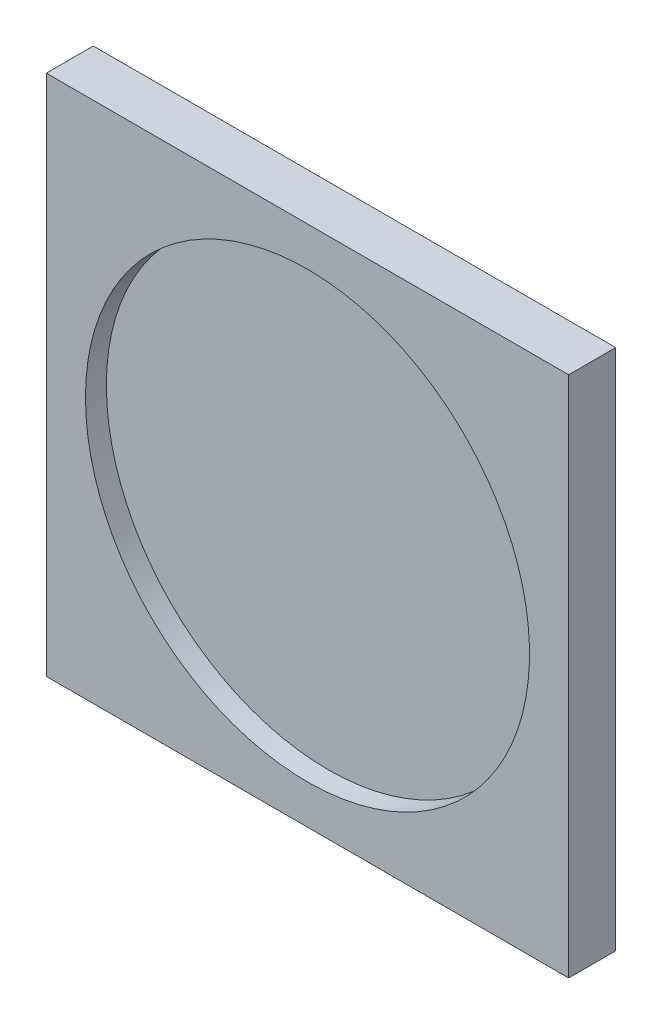
ISO-10303-21;
HEADER;
FILE_DESCRIPTION(('STEP AP214'),'2;1');
FILE_NAME('part.step','',(''),(''),'','','');
FILE_SCHEMA(('AUTOMOTIVE_DESIGN { 1 0 10303 214 1 1 1 1 }'));
ENDSEC;
DATA;
#1=APPLICATION_CONTEXT('core data for automotive mechanical design processes');
#2=APPLICATION_PROTOCOL_DEFINITION('international standard','automotive_design',2000,#1);
#3=PRODUCT_CONTEXT('',#1,'mechanical');
#4=PRODUCT('Part','Part','',(#3));
#5=PRODUCT_RELATED_PRODUCT_CATEGORY('part','',(#4));
#6=PRODUCT_DEFINITION_FORMATION('','',#4);
#7=PRODUCT_DEFINITION_CONTEXT('part definition',#1,'design');
#8=PRODUCT_DEFINITION('design','',#6,#7);
#9=PRODUCT_DEFINITION_SHAPE('','',#8);
#10=(LENGTH_UNIT() NAMED_UNIT(*) SI_UNIT(.MILLI.,.METRE.));
#11=(NAMED_UNIT(*) PLANE_ANGLE_UNIT() SI_UNIT($,.RADIAN.));
#12=(NAMED_UNIT(*) SI_UNIT($,.STERADIAN.) SOLID_ANGLE_UNIT());
#13=UNCERTAINTY_MEASURE_WITH_UNIT(LENGTH_MEASURE(1.E-05),#10,'distance_accuracy_value','');
#14=(GEOMETRIC_REPRESENTATION_CONTEXT(3) GLOBAL_UNCERTAINTY_ASSIGNED_CONTEXT((#13)) GLOBAL_UNIT_ASSIGNED_CONTEXT((#10,
#11,#12)) REPRESENTATION_CONTEXT('',''));
#15=CARTESIAN_POINT('',(0.,0.,0.));
#16=DIRECTION('',(0.,0.,1.));
#17=DIRECTION('',(1.,0.,0.));
#18=AXIS2_PLACEMENT_3D('',#15,#16,#17);
#19=CARTESIAN_POINT('',(50.,-50.,9.));
#20=DIRECTION('',(0.,1.,0.));
#21=DIRECTION('',(0.,0.,1.));
#22=AXIS2_PLACEMENT_3D('',#19,#20,#21);
#23=PLANE('',#22);
#24=DIRECTION('',(0.,0.,-1.));
#25=VECTOR('',#24,1.);
#26=CARTESIAN_POINT('',(-50.,-50.,9.));
#27=LINE('',#26,#25);
#28=CARTESIAN_POINT('',(-50.,-50.,9.));
#29=VERTEX_POINT('',#28);
#30=CARTESIAN_POINT('',(-50.,-50.,0.));
#31=VERTEX_POINT('',#30);
#32=EDGE_CURVE('E108',#29,#31,#27,.T.);
#33=ORIENTED_EDGE('',*,*,#32,.T.);
#34=DIRECTION('',(-1.,0.,0.));
#35=VECTOR('',#34,1.);
#36=CARTESIAN_POINT('',(50.,-50.,0.));
#37=LINE('',#36,#35);
#38=CARTESIAN_POINT('',(50.,-50.,0.));
#39=VERTEX_POINT('',#38);
#40=EDGE_CURVE('E11',#39,#31,#37,.T.);
#41=ORIENTED_EDGE('',*,*,#40,.F.);
#42=DIRECTION('',(0.,0.,-1.));
#43=VECTOR('',#42,1.);
#44=CARTESIAN_POINT('',(50.,-50.,9.));
#45=LINE('',#44,#43);
#46=CARTESIAN_POINT('',(50.,-50.,9.));
#47=VERTEX_POINT('',#46);
#48=EDGE_CURVE('E95',#47,#39,#45,.T.);
#49=ORIENTED_EDGE('',*,*,#48,.F.);
#50=DIRECTION('',(-1.,0.,0.));
#51=VECTOR('',#50,1.);
#52=CARTESIAN_POINT('',(50.,-50.,9.));
#53=LINE('',#52,#51);
#54=EDGE_CURVE('E104',#47,#29,#53,.T.);
#55=ORIENTED_EDGE('',*,*,#54,.T.);
#56=EDGE_LOOP('',(#33,#41,#49,#55));
#57=FACE_BOUND('',#56,.T.);
#58=ADVANCED_FACE('F43',(#57),#23,.F.);
#59=CARTESIAN_POINT('',(50.,-50.,0.));
#60=DIRECTION('',(0.,0.,1.));
#61=DIRECTION('',(1.,0.,0.));
#62=AXIS2_PLACEMENT_3D('',#59,#60,#61);
#63=PLANE('',#62);
#64=DIRECTION('',(0.,1.,0.));
#65=VECTOR('',#64,1.);
#66=CARTESIAN_POINT('',(-50.,-50.,0.));
#67=LINE('',#66,#65);
#68=CARTESIAN_POINT('',(-50.,50.,0.));
#69=VERTEX_POINT('',#68);
#70=EDGE_CURVE('E99',#31,#69,#67,.T.);
#71=ORIENTED_EDGE('',*,*,#70,.T.);
#72=DIRECTION('',(-1.,0.,0.));
#73=VECTOR('',#72,1.);
#74=CARTESIAN_POINT('',(50.,50.,0.));
#75=LINE('',#74,#73);
#76=CARTESIAN_POINT('',(50.,50.,0.));
#77=VERTEX_POINT('',#76);
#78=EDGE_CURVE('E52',#77,#69,#75,.T.);
#79=ORIENTED_EDGE('',*,*,#78,.F.);
#80=DIRECTION('',(0.,1.,0.));
#81=VECTOR('',#80,1.);
#82=CARTESIAN_POINT('',(50.,-50.,0.));
#83=LINE('',#82,#81);
#84=EDGE_CURVE('E90',#39,#77,#83,.T.);
#85=ORIENTED_EDGE('',*,*,#84,.F.);
#86=ORIENTED_EDGE('',*,*,#40,.T.);
#87=EDGE_LOOP('',(#71,#79,#85,#86));
#88=FACE_BOUND('',#87,.T.);
#89=ADVANCED_FACE('F98',(#88),#63,.F.);
#90=CARTESIAN_POINT('',(50.,50.,9.));
#91=DIRECTION('',(0.,-1.,0.));
#92=DIRECTION('',(0.,0.,-1.));
#93=AXIS2_PLACEMENT_3D('',#90,#91,#92);
#94=PLANE('',#93);
#95=DIRECTION('',(0.,0.,1.));
#96=VECTOR('',#95,1.);
#97=CARTESIAN_POINT('',(-50.,50.,9.));
#98=LINE('',#97,#96);
#99=CARTESIAN_POINT('',(-50.,50.,9.));
#100=VERTEX_POINT('',#99);
#101=EDGE_CURVE('E77',#69,#100,#98,.T.);
#102=ORIENTED_EDGE('',*,*,#101,.T.);
#103=DIRECTION('',(-1.,0.,0.));
#104=VECTOR('',#103,1.);
#105=CARTESIAN_POINT('',(50.,50.,9.));
#106=LINE('',#105,#104);
#107=CARTESIAN_POINT('',(50.,50.,9.));
#108=VERTEX_POINT('',#107);
#109=EDGE_CURVE('E100',#108,#100,#106,.T.);
#110=ORIENTED_EDGE('',*,*,#109,.F.);
#111=DIRECTION('',(0.,0.,1.));
#112=VECTOR('',#111,1.);
#113=CARTESIAN_POINT('',(50.,50.,9.));
#114=LINE('',#113,#112);
#115=EDGE_CURVE('E93',#77,#108,#114,.T.);
#116=ORIENTED_EDGE('',*,*,#115,.F.);
#117=ORIENTED_EDGE('',*,*,#78,.T.);
#118=EDGE_LOOP('',(#102,#110,#116,#117));
#119=FACE_BOUND('',#118,.T.);
#120=ADVANCED_FACE('F102',(#119),#94,.F.);
#121=CARTESIAN_POINT('',(50.,-50.,9.));
#122=DIRECTION('',(0.,0.,-1.));
#123=DIRECTION('',(-1.,0.,0.));
#124=AXIS2_PLACEMENT_3D('',#121,#122,#123);
#125=PLANE('',#124);
#126=CARTESIAN_POINT('',(0.,0.,9.));
#127=DIRECTION('',(0.,0.,-1.));
#128=DIRECTION('',(-1.,0.,0.));
#129=AXIS2_PLACEMENT_3D('',#126,#127,#128);
#130=CIRCLE('',#129,42.5);
#131=CARTESIAN_POINT('',(-42.5,0.,9.));
#132=VERTEX_POINT('',#131);
#133=EDGE_CURVE('E46',#132,#132,#130,.F.);
#134=ORIENTED_EDGE('',*,*,#133,.F.);
#135=EDGE_LOOP('',(#134));
#136=FACE_BOUND('',#135,.T.);
#137=DIRECTION('',(0.,-1.,0.));
#138=VECTOR('',#137,1.);
#139=CARTESIAN_POINT('',(-50.,-50.,9.));
#140=LINE('',#139,#138);
#141=EDGE_CURVE('E83',#100,#29,#140,.T.);
#142=ORIENTED_EDGE('',*,*,#141,.T.);
#143=ORIENTED_EDGE('',*,*,#54,.F.);
#144=DIRECTION('',(0.,-1.,0.));
#145=VECTOR('',#144,1.);
#146=CARTESIAN_POINT('',(50.,-50.,9.));
#147=LINE('',#146,#145);
#148=EDGE_CURVE('E60',#108,#47,#147,.T.);
#149=ORIENTED_EDGE('',*,*,#148,.F.);
#150=ORIENTED_EDGE('',*,*,#109,.T.);
#151=EDGE_LOOP('',(#142,#143,#149,#150));
#152=FACE_BOUND('',#151,.T.);
#153=ADVANCED_FACE('F115',(#136,#152),#125,.F.);
#154=CARTESIAN_POINT('',(50.,0.,0.));
#155=DIRECTION('',(1.,0.,0.));
#156=DIRECTION('',(0.,0.,-1.));
#157=AXIS2_PLACEMENT_3D('',#154,#155,#156);
#158=PLANE('',#157);
#159=ORIENTED_EDGE('',*,*,#48,.T.);
#160=ORIENTED_EDGE('',*,*,#84,.T.);
#161=ORIENTED_EDGE('',*,*,#115,.T.);
#162=ORIENTED_EDGE('',*,*,#148,.T.);
#163=EDGE_LOOP('',(#159,#160,#161,#162));
#164=FACE_BOUND('',#163,.T.);
#165=ADVANCED_FACE('F91',(#164),#158,.T.);
#166=CARTESIAN_POINT('',(-50.,0.,0.));
#167=DIRECTION('',(1.,0.,0.));
#168=DIRECTION('',(0.,0.,-1.));
#169=AXIS2_PLACEMENT_3D('',#166,#167,#168);
#170=PLANE('',#169);
#171=ORIENTED_EDGE('',*,*,#32,.F.);
#172=ORIENTED_EDGE('',*,*,#141,.F.);
#173=ORIENTED_EDGE('',*,*,#101,.F.);
#174=ORIENTED_EDGE('',*,*,#70,.F.);
#175=EDGE_LOOP('',(#171,#172,#173,#174));
#176=FACE_BOUND('',#175,.T.);
#177=ADVANCED_FACE('F118',(#176),#170,.F.);
#178=CARTESIAN_POINT('',(0.,0.,9.000012));
#179=DIRECTION('',(0.,0.,-1.));
#180=DIRECTION('',(-1.,0.,0.));
#181=AXIS2_PLACEMENT_3D('',#178,#179,#180);
#182=CYLINDRICAL_SURFACE('',#181,42.5);
#183=CARTESIAN_POINT('',(0.,0.,5.));
#184=DIRECTION('',(0.,0.,1.));
#185=DIRECTION('',(1.,0.,0.));
#186=AXIS2_PLACEMENT_3D('',#183,#184,#185);
#187=CIRCLE('',#186,42.5);
#188=CARTESIAN_POINT('',(42.5,0.,5.));
#189=VERTEX_POINT('',#188);
#190=EDGE_CURVE('E121',#189,#189,#187,.T.);
#191=ORIENTED_EDGE('',*,*,#190,.F.);
#192=EDGE_LOOP('',(#191));
#193=FACE_BOUND('',#192,.T.);
#194=ORIENTED_EDGE('',*,*,#133,.T.);
#195=EDGE_LOOP('',(#194));
#196=FACE_BOUND('',#195,.T.);
#197=ADVANCED_FACE('F128',(#193,#196),#182,.F.);
#198=CARTESIAN_POINT('',(0.,0.,5.));
#199=DIRECTION('',(0.,0.,1.));
#200=DIRECTION('',(1.,0.,0.));
#201=AXIS2_PLACEMENT_3D('',#198,#199,#200);
#202=PLANE('',#201);
#203=ORIENTED_EDGE('',*,*,#190,.T.);
#204=EDGE_LOOP('',(#203));
#205=FACE_BOUND('',#204,.T.);
#206=ADVANCED_FACE('F171',(#205),#202,.T.);
#207=CLOSED_SHELL('',(#58,#89,#120,#153,#165,#177,#197,#206));
#208=MANIFOLD_SOLID_BREP('B2',#207);
#209=ADVANCED_BREP_SHAPE_REPRESENTATION('',(#18,#208),#14);
#210=SHAPE_DEFINITION_REPRESENTATION(#9,#209);
ENDSEC;
END-ISO-10303-21;
